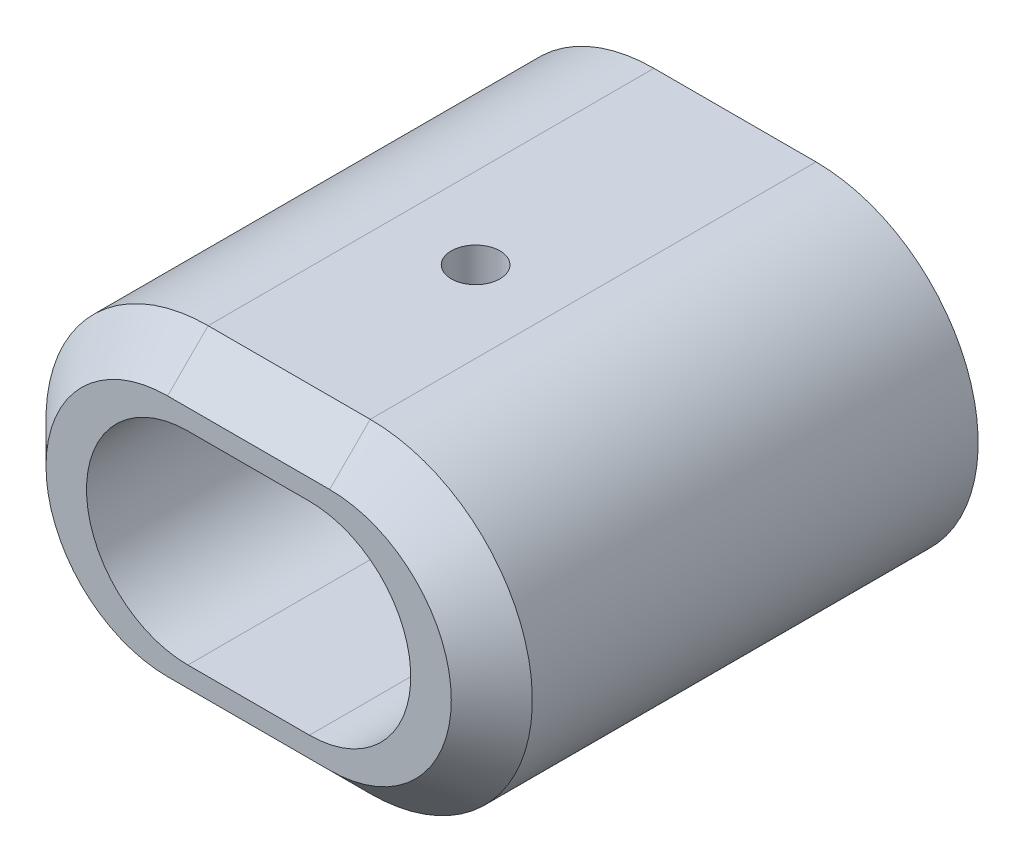
ISO-10303-21;
HEADER;
FILE_DESCRIPTION(('STEP AP214'),'2;1');
FILE_NAME('part.step','',(''),(''),'','','');
FILE_SCHEMA(('AUTOMOTIVE_DESIGN { 1 0 10303 214 1 1 1 1 }'));
ENDSEC;
DATA;
#1=APPLICATION_CONTEXT('core data for automotive mechanical design processes');
#2=APPLICATION_PROTOCOL_DEFINITION('international standard','automotive_design',2000,#1);
#3=PRODUCT_CONTEXT('',#1,'mechanical');
#4=PRODUCT('Part','Part','',(#3));
#5=PRODUCT_RELATED_PRODUCT_CATEGORY('part','',(#4));
#6=PRODUCT_DEFINITION_FORMATION('','',#4);
#7=PRODUCT_DEFINITION_CONTEXT('part definition',#1,'design');
#8=PRODUCT_DEFINITION('design','',#6,#7);
#9=PRODUCT_DEFINITION_SHAPE('','',#8);
#10=(LENGTH_UNIT() NAMED_UNIT(*) SI_UNIT(.MILLI.,.METRE.));
#11=(NAMED_UNIT(*) PLANE_ANGLE_UNIT() SI_UNIT($,.RADIAN.));
#12=(NAMED_UNIT(*) SI_UNIT($,.STERADIAN.) SOLID_ANGLE_UNIT());
#13=UNCERTAINTY_MEASURE_WITH_UNIT(LENGTH_MEASURE(1.E-05),#10,'distance_accuracy_value','');
#14=(GEOMETRIC_REPRESENTATION_CONTEXT(3) GLOBAL_UNCERTAINTY_ASSIGNED_CONTEXT((#13)) GLOBAL_UNIT_ASSIGNED_CONTEXT((#10,
#11,#12)) REPRESENTATION_CONTEXT('',''));
#15=CARTESIAN_POINT('',(0.,0.,0.));
#16=DIRECTION('',(0.,0.,1.));
#17=DIRECTION('',(1.,0.,0.));
#18=AXIS2_PLACEMENT_3D('',#15,#16,#17);
#19=CARTESIAN_POINT('',(-10.,0.,60.));
#20=DIRECTION('',(0.,0.,1.));
#21=DIRECTION('',(1.,0.,0.));
#22=AXIS2_PLACEMENT_3D('',#19,#20,#21);
#23=PLANE('',#22);
#24=CARTESIAN_POINT('',(10.,0.,60.));
#25=DIRECTION('',(0.,0.,1.));
#26=DIRECTION('',(1.,0.,0.));
#27=AXIS2_PLACEMENT_3D('',#24,#25,#26);
#28=CIRCLE('',#27,15.);
#29=CARTESIAN_POINT('',(9.99999999999999,-15.,60.));
#30=VERTEX_POINT('',#29);
#31=CARTESIAN_POINT('',(9.99999999999999,15.,60.));
#32=VERTEX_POINT('',#31);
#33=EDGE_CURVE('E183',#30,#32,#28,.T.);
#34=ORIENTED_EDGE('',*,*,#33,.T.);
#35=DIRECTION('',(-1.,0.,0.));
#36=VECTOR('',#35,1.);
#37=CARTESIAN_POINT('',(-9.99999999999999,15.,60.));
#38=LINE('',#37,#36);
#39=CARTESIAN_POINT('',(-9.99999999999999,15.,60.));
#40=VERTEX_POINT('',#39);
#41=EDGE_CURVE('E185',#32,#40,#38,.T.);
#42=ORIENTED_EDGE('',*,*,#41,.T.);
#43=CARTESIAN_POINT('',(-10.,0.,60.));
#44=DIRECTION('',(0.,0.,1.));
#45=DIRECTION('',(1.,0.,0.));
#46=AXIS2_PLACEMENT_3D('',#43,#44,#45);
#47=CIRCLE('',#46,15.);
#48=CARTESIAN_POINT('',(-9.99999999999999,-15.,60.));
#49=VERTEX_POINT('',#48);
#50=EDGE_CURVE('E174',#40,#49,#47,.T.);
#51=ORIENTED_EDGE('',*,*,#50,.T.);
#52=DIRECTION('',(1.,0.,0.));
#53=VECTOR('',#52,1.);
#54=CARTESIAN_POINT('',(9.99999999999999,-15.,60.));
#55=LINE('',#54,#53);
#56=EDGE_CURVE('E181',#49,#30,#55,.T.);
#57=ORIENTED_EDGE('',*,*,#56,.T.);
#58=EDGE_LOOP('',(#34,#42,#51,#57));
#59=FACE_BOUND('',#58,.T.);
#60=DIRECTION('',(1.,0.,0.));
#61=VECTOR('',#60,1.);
#62=CARTESIAN_POINT('',(-7.5,-12.5,60.));
#63=LINE('',#62,#61);
#64=CARTESIAN_POINT('',(-7.5,-12.5,60.));
#65=VERTEX_POINT('',#64);
#66=CARTESIAN_POINT('',(7.5,-12.5,60.));
#67=VERTEX_POINT('',#66);
#68=EDGE_CURVE('E122',#65,#67,#63,.T.);
#69=ORIENTED_EDGE('',*,*,#68,.F.);
#70=CARTESIAN_POINT('',(-7.5,0.,60.));
#71=DIRECTION('',(0.,0.,1.));
#72=DIRECTION('',(1.,0.,0.));
#73=AXIS2_PLACEMENT_3D('',#70,#71,#72);
#74=CIRCLE('',#73,12.5);
#75=CARTESIAN_POINT('',(-7.5,12.5,60.));
#76=VERTEX_POINT('',#75);
#77=EDGE_CURVE('E112',#76,#65,#74,.T.);
#78=ORIENTED_EDGE('',*,*,#77,.F.);
#79=DIRECTION('',(-1.,0.,0.));
#80=VECTOR('',#79,1.);
#81=CARTESIAN_POINT('',(-7.5,12.5,60.));
#82=LINE('',#81,#80);
#83=CARTESIAN_POINT('',(7.5,12.5,60.));
#84=VERTEX_POINT('',#83);
#85=EDGE_CURVE('E137',#84,#76,#82,.T.);
#86=ORIENTED_EDGE('',*,*,#85,.F.);
#87=CARTESIAN_POINT('',(7.5,0.,60.));
#88=DIRECTION('',(0.,0.,1.));
#89=DIRECTION('',(1.,0.,0.));
#90=AXIS2_PLACEMENT_3D('',#87,#88,#89);
#91=CIRCLE('',#90,12.5);
#92=EDGE_CURVE('E135',#67,#84,#91,.T.);
#93=ORIENTED_EDGE('',*,*,#92,.F.);
#94=EDGE_LOOP('',(#69,#78,#86,#93));
#95=FACE_BOUND('',#94,.T.);
#96=ADVANCED_FACE('F33',(#59,#95),#23,.T.);
#97=CARTESIAN_POINT('',(-10.,0.,0.));
#98=DIRECTION('',(0.,0.,1.));
#99=DIRECTION('',(1.,0.,0.));
#100=AXIS2_PLACEMENT_3D('',#97,#98,#99);
#101=PLANE('',#100);
#102=CARTESIAN_POINT('',(-10.,0.,0.));
#103=DIRECTION('',(0.,0.,1.));
#104=DIRECTION('',(1.,0.,0.));
#105=AXIS2_PLACEMENT_3D('',#102,#103,#104);
#106=CIRCLE('',#105,20.);
#107=CARTESIAN_POINT('',(-9.99999999999999,20.,0.));
#108=VERTEX_POINT('',#107);
#109=CARTESIAN_POINT('',(-9.99999999999999,-20.,0.));
#110=VERTEX_POINT('',#109);
#111=EDGE_CURVE('E130',#108,#110,#106,.T.);
#112=ORIENTED_EDGE('',*,*,#111,.F.);
#113=DIRECTION('',(-1.,0.,0.));
#114=VECTOR('',#113,1.);
#115=CARTESIAN_POINT('',(-9.99999999999999,20.,0.));
#116=LINE('',#115,#114);
#117=CARTESIAN_POINT('',(9.99999999999999,20.,0.));
#118=VERTEX_POINT('',#117);
#119=EDGE_CURVE('E163',#118,#108,#116,.T.);
#120=ORIENTED_EDGE('',*,*,#119,.F.);
#121=CARTESIAN_POINT('',(10.,0.,0.));
#122=DIRECTION('',(0.,0.,1.));
#123=DIRECTION('',(1.,0.,0.));
#124=AXIS2_PLACEMENT_3D('',#121,#122,#123);
#125=CIRCLE('',#124,20.);
#126=CARTESIAN_POINT('',(9.99999999999999,-20.,0.));
#127=VERTEX_POINT('',#126);
#128=EDGE_CURVE('E160',#127,#118,#125,.T.);
#129=ORIENTED_EDGE('',*,*,#128,.F.);
#130=DIRECTION('',(1.,0.,0.));
#131=VECTOR('',#130,1.);
#132=CARTESIAN_POINT('',(-9.99999999999999,-20.,0.));
#133=LINE('',#132,#131);
#134=EDGE_CURVE('E157',#110,#127,#133,.T.);
#135=ORIENTED_EDGE('',*,*,#134,.F.);
#136=EDGE_LOOP('',(#112,#120,#129,#135));
#137=FACE_BOUND('',#136,.T.);
#138=CARTESIAN_POINT('',(-7.5,0.,0.));
#139=DIRECTION('',(0.,0.,1.));
#140=DIRECTION('',(1.,0.,0.));
#141=AXIS2_PLACEMENT_3D('',#138,#139,#140);
#142=CIRCLE('',#141,12.5);
#143=CARTESIAN_POINT('',(-7.5,12.5,0.));
#144=VERTEX_POINT('',#143);
#145=CARTESIAN_POINT('',(-7.5,-12.5,0.));
#146=VERTEX_POINT('',#145);
#147=EDGE_CURVE('E142',#144,#146,#142,.T.);
#148=ORIENTED_EDGE('',*,*,#147,.T.);
#149=DIRECTION('',(1.,0.,0.));
#150=VECTOR('',#149,1.);
#151=CARTESIAN_POINT('',(-7.5,-12.5,0.));
#152=LINE('',#151,#150);
#153=CARTESIAN_POINT('',(7.5,-12.5,0.));
#154=VERTEX_POINT('',#153);
#155=EDGE_CURVE('E129',#146,#154,#152,.T.);
#156=ORIENTED_EDGE('',*,*,#155,.T.);
#157=CARTESIAN_POINT('',(7.5,0.,0.));
#158=DIRECTION('',(0.,0.,1.));
#159=DIRECTION('',(1.,0.,0.));
#160=AXIS2_PLACEMENT_3D('',#157,#158,#159);
#161=CIRCLE('',#160,12.5);
#162=CARTESIAN_POINT('',(7.5,12.5,0.));
#163=VERTEX_POINT('',#162);
#164=EDGE_CURVE('E146',#154,#163,#161,.T.);
#165=ORIENTED_EDGE('',*,*,#164,.T.);
#166=DIRECTION('',(-1.,0.,0.));
#167=VECTOR('',#166,1.);
#168=CARTESIAN_POINT('',(-7.5,12.5,0.));
#169=LINE('',#168,#167);
#170=EDGE_CURVE('E123',#163,#144,#169,.T.);
#171=ORIENTED_EDGE('',*,*,#170,.T.);
#172=EDGE_LOOP('',(#148,#156,#165,#171));
#173=FACE_BOUND('',#172,.T.);
#174=ADVANCED_FACE('F233',(#137,#173),#101,.F.);
#175=CARTESIAN_POINT('',(-10.,0.,60.));
#176=DIRECTION('',(0.,0.,-1.));
#177=DIRECTION('',(-1.,0.,0.));
#178=AXIS2_PLACEMENT_3D('',#175,#176,#177);
#179=CYLINDRICAL_SURFACE('',#178,20.);
#180=DIRECTION('',(0.,0.,-1.));
#181=VECTOR('',#180,1.);
#182=CARTESIAN_POINT('',(-9.99999999999999,-20.,60.));
#183=LINE('',#182,#181);
#184=CARTESIAN_POINT('',(-9.99999999999999,-20.,55.));
#185=VERTEX_POINT('',#184);
#186=EDGE_CURVE('E172',#185,#110,#183,.T.);
#187=ORIENTED_EDGE('',*,*,#186,.F.);
#188=CARTESIAN_POINT('',(-10.,0.,55.));
#189=DIRECTION('',(0.,0.,1.));
#190=DIRECTION('',(1.,0.,0.));
#191=AXIS2_PLACEMENT_3D('',#188,#189,#190);
#192=CIRCLE('',#191,20.);
#193=CARTESIAN_POINT('',(-9.99999999999999,20.,55.));
#194=VERTEX_POINT('',#193);
#195=EDGE_CURVE('E11',#185,#194,#192,.F.);
#196=ORIENTED_EDGE('',*,*,#195,.T.);
#197=DIRECTION('',(0.,0.,-1.));
#198=VECTOR('',#197,1.);
#199=CARTESIAN_POINT('',(-9.99999999999999,20.,60.));
#200=LINE('',#199,#198);
#201=EDGE_CURVE('E166',#194,#108,#200,.T.);
#202=ORIENTED_EDGE('',*,*,#201,.T.);
#203=ORIENTED_EDGE('',*,*,#111,.T.);
#204=EDGE_LOOP('',(#187,#196,#202,#203));
#205=FACE_BOUND('',#204,.T.);
#206=ADVANCED_FACE('F239',(#205),#179,.T.);
#207=CARTESIAN_POINT('',(-9.99999999999999,-20.,60.));
#208=DIRECTION('',(0.,1.,0.));
#209=DIRECTION('',(0.,0.,1.));
#210=AXIS2_PLACEMENT_3D('',#207,#208,#209);
#211=PLANE('',#210);
#212=CARTESIAN_POINT('',(0.,-20.,32.));
#213=DIRECTION('',(0.,-1.,0.));
#214=DIRECTION('',(0.,0.,-1.));
#215=AXIS2_PLACEMENT_3D('',#212,#213,#214);
#216=CIRCLE('',#215,3.);
#217=CARTESIAN_POINT('',(0.,-20.,29.));
#218=VERTEX_POINT('',#217);
#219=EDGE_CURVE('E179',#218,#218,#216,.T.);
#220=ORIENTED_EDGE('',*,*,#219,.F.);
#221=EDGE_LOOP('',(#220));
#222=FACE_BOUND('',#221,.T.);
#223=DIRECTION('',(0.,0.,-1.));
#224=VECTOR('',#223,1.);
#225=CARTESIAN_POINT('',(9.99999999999999,-20.,60.));
#226=LINE('',#225,#224);
#227=CARTESIAN_POINT('',(9.99999999999999,-20.,55.));
#228=VERTEX_POINT('',#227);
#229=EDGE_CURVE('E170',#228,#127,#226,.T.);
#230=ORIENTED_EDGE('',*,*,#229,.F.);
#231=DIRECTION('',(-1.,0.,0.));
#232=VECTOR('',#231,1.);
#233=CARTESIAN_POINT('',(-9.99999999999999,-20.,55.));
#234=LINE('',#233,#232);
#235=EDGE_CURVE('E42',#228,#185,#234,.T.);
#236=ORIENTED_EDGE('',*,*,#235,.T.);
#237=ORIENTED_EDGE('',*,*,#186,.T.);
#238=ORIENTED_EDGE('',*,*,#134,.T.);
#239=EDGE_LOOP('',(#230,#236,#237,#238));
#240=FACE_BOUND('',#239,.T.);
#241=ADVANCED_FACE('F250',(#222,#240),#211,.F.);
#242=CARTESIAN_POINT('',(10.,0.,60.));
#243=DIRECTION('',(0.,0.,-1.));
#244=DIRECTION('',(-1.,0.,0.));
#245=AXIS2_PLACEMENT_3D('',#242,#243,#244);
#246=CYLINDRICAL_SURFACE('',#245,20.);
#247=DIRECTION('',(0.,0.,-1.));
#248=VECTOR('',#247,1.);
#249=CARTESIAN_POINT('',(9.99999999999999,20.,60.));
#250=LINE('',#249,#248);
#251=CARTESIAN_POINT('',(9.99999999999999,20.,55.));
#252=VERTEX_POINT('',#251);
#253=EDGE_CURVE('E168',#252,#118,#250,.T.);
#254=ORIENTED_EDGE('',*,*,#253,.F.);
#255=CARTESIAN_POINT('',(10.,0.,55.));
#256=DIRECTION('',(0.,0.,1.));
#257=DIRECTION('',(1.,0.,0.));
#258=AXIS2_PLACEMENT_3D('',#255,#256,#257);
#259=CIRCLE('',#258,20.);
#260=EDGE_CURVE('E57',#252,#228,#259,.F.);
#261=ORIENTED_EDGE('',*,*,#260,.T.);
#262=ORIENTED_EDGE('',*,*,#229,.T.);
#263=ORIENTED_EDGE('',*,*,#128,.T.);
#264=EDGE_LOOP('',(#254,#261,#262,#263));
#265=FACE_BOUND('',#264,.T.);
#266=ADVANCED_FACE('F247',(#265),#246,.T.);
#267=CARTESIAN_POINT('',(-9.99999999999999,20.,60.));
#268=DIRECTION('',(0.,-1.,0.));
#269=DIRECTION('',(0.,0.,-1.));
#270=AXIS2_PLACEMENT_3D('',#267,#268,#269);
#271=PLANE('',#270);
#272=CARTESIAN_POINT('',(0.,20.,32.));
#273=DIRECTION('',(0.,-1.,0.));
#274=DIRECTION('',(0.,0.,-1.));
#275=AXIS2_PLACEMENT_3D('',#272,#273,#274);
#276=CIRCLE('',#275,3.);
#277=CARTESIAN_POINT('',(0.,20.,29.));
#278=VERTEX_POINT('',#277);
#279=EDGE_CURVE('E144',#278,#278,#276,.T.);
#280=ORIENTED_EDGE('',*,*,#279,.T.);
#281=EDGE_LOOP('',(#280));
#282=FACE_BOUND('',#281,.T.);
#283=ORIENTED_EDGE('',*,*,#201,.F.);
#284=DIRECTION('',(1.,0.,0.));
#285=VECTOR('',#284,1.);
#286=CARTESIAN_POINT('',(9.99999999999999,20.,55.));
#287=LINE('',#286,#285);
#288=EDGE_CURVE('E188',#194,#252,#287,.T.);
#289=ORIENTED_EDGE('',*,*,#288,.T.);
#290=ORIENTED_EDGE('',*,*,#253,.T.);
#291=ORIENTED_EDGE('',*,*,#119,.T.);
#292=EDGE_LOOP('',(#283,#289,#290,#291));
#293=FACE_BOUND('',#292,.T.);
#294=ADVANCED_FACE('F215',(#282,#293),#271,.F.);
#295=CARTESIAN_POINT('',(-7.5,0.,60.));
#296=DIRECTION('',(0.,0.,-1.));
#297=DIRECTION('',(-1.,0.,0.));
#298=AXIS2_PLACEMENT_3D('',#295,#296,#297);
#299=CYLINDRICAL_SURFACE('',#298,12.5);
#300=ORIENTED_EDGE('',*,*,#147,.F.);
#301=DIRECTION('',(0.,0.,-1.));
#302=VECTOR('',#301,1.);
#303=CARTESIAN_POINT('',(-7.5,12.5,60.));
#304=LINE('',#303,#302);
#305=EDGE_CURVE('E118',#76,#144,#304,.T.);
#306=ORIENTED_EDGE('',*,*,#305,.F.);
#307=ORIENTED_EDGE('',*,*,#77,.T.);
#308=DIRECTION('',(0.,0.,-1.));
#309=VECTOR('',#308,1.);
#310=CARTESIAN_POINT('',(-7.5,-12.5,60.));
#311=LINE('',#310,#309);
#312=EDGE_CURVE('E115',#65,#146,#311,.T.);
#313=ORIENTED_EDGE('',*,*,#312,.T.);
#314=EDGE_LOOP('',(#300,#306,#307,#313));
#315=FACE_BOUND('',#314,.T.);
#316=ADVANCED_FACE('F114',(#315),#299,.F.);
#317=CARTESIAN_POINT('',(-7.5,-12.5,60.));
#318=DIRECTION('',(0.,1.,0.));
#319=DIRECTION('',(0.,0.,1.));
#320=AXIS2_PLACEMENT_3D('',#317,#318,#319);
#321=PLANE('',#320);
#322=CARTESIAN_POINT('',(0.,-12.5,32.));
#323=DIRECTION('',(0.,1.,0.));
#324=DIRECTION('',(0.,0.,1.));
#325=AXIS2_PLACEMENT_3D('',#322,#323,#324);
#326=CIRCLE('',#325,3.);
#327=CARTESIAN_POINT('',(0.,-12.5,35.));
#328=VERTEX_POINT('',#327);
#329=EDGE_CURVE('E178',#328,#328,#326,.T.);
#330=ORIENTED_EDGE('',*,*,#329,.F.);
#331=EDGE_LOOP('',(#330));
#332=FACE_BOUND('',#331,.T.);
#333=ORIENTED_EDGE('',*,*,#155,.F.);
#334=ORIENTED_EDGE('',*,*,#312,.F.);
#335=ORIENTED_EDGE('',*,*,#68,.T.);
#336=DIRECTION('',(0.,0.,-1.));
#337=VECTOR('',#336,1.);
#338=CARTESIAN_POINT('',(7.5,-12.5,60.));
#339=LINE('',#338,#337);
#340=EDGE_CURVE('E131',#67,#154,#339,.T.);
#341=ORIENTED_EDGE('',*,*,#340,.T.);
#342=EDGE_LOOP('',(#333,#334,#335,#341));
#343=FACE_BOUND('',#342,.T.);
#344=ADVANCED_FACE('F126',(#332,#343),#321,.T.);
#345=CARTESIAN_POINT('',(7.5,0.,60.));
#346=DIRECTION('',(0.,0.,-1.));
#347=DIRECTION('',(-1.,0.,0.));
#348=AXIS2_PLACEMENT_3D('',#345,#346,#347);
#349=CYLINDRICAL_SURFACE('',#348,12.5);
#350=ORIENTED_EDGE('',*,*,#164,.F.);
#351=ORIENTED_EDGE('',*,*,#340,.F.);
#352=ORIENTED_EDGE('',*,*,#92,.T.);
#353=DIRECTION('',(0.,0.,-1.));
#354=VECTOR('',#353,1.);
#355=CARTESIAN_POINT('',(7.5,12.5,60.));
#356=LINE('',#355,#354);
#357=EDGE_CURVE('E152',#84,#163,#356,.T.);
#358=ORIENTED_EDGE('',*,*,#357,.T.);
#359=EDGE_LOOP('',(#350,#351,#352,#358));
#360=FACE_BOUND('',#359,.T.);
#361=ADVANCED_FACE('F229',(#360),#349,.F.);
#362=CARTESIAN_POINT('',(-7.5,12.5,60.));
#363=DIRECTION('',(0.,-1.,0.));
#364=DIRECTION('',(0.,0.,-1.));
#365=AXIS2_PLACEMENT_3D('',#362,#363,#364);
#366=PLANE('',#365);
#367=CARTESIAN_POINT('',(0.,12.5,32.));
#368=DIRECTION('',(0.,-1.,0.));
#369=DIRECTION('',(0.,0.,-1.));
#370=AXIS2_PLACEMENT_3D('',#367,#368,#369);
#371=CIRCLE('',#370,3.);
#372=CARTESIAN_POINT('',(0.,12.5,29.));
#373=VERTEX_POINT('',#372);
#374=EDGE_CURVE('E175',#373,#373,#371,.T.);
#375=ORIENTED_EDGE('',*,*,#374,.F.);
#376=EDGE_LOOP('',(#375));
#377=FACE_BOUND('',#376,.T.);
#378=ORIENTED_EDGE('',*,*,#170,.F.);
#379=ORIENTED_EDGE('',*,*,#357,.F.);
#380=ORIENTED_EDGE('',*,*,#85,.T.);
#381=ORIENTED_EDGE('',*,*,#305,.T.);
#382=EDGE_LOOP('',(#378,#379,#380,#381));
#383=FACE_BOUND('',#382,.T.);
#384=ADVANCED_FACE('F221',(#377,#383),#366,.T.);
#385=CARTESIAN_POINT('',(0.,40.,32.));
#386=DIRECTION('',(0.,-1.,0.));
#387=DIRECTION('',(0.,0.,-1.));
#388=AXIS2_PLACEMENT_3D('',#385,#386,#387);
#389=CYLINDRICAL_SURFACE('',#388,3.);
#390=ORIENTED_EDGE('',*,*,#374,.T.);
#391=EDGE_LOOP('',(#390));
#392=FACE_BOUND('',#391,.T.);
#393=ORIENTED_EDGE('',*,*,#279,.F.);
#394=EDGE_LOOP('',(#393));
#395=FACE_BOUND('',#394,.T.);
#396=ADVANCED_FACE('F218',(#392,#395),#389,.F.);
#397=ORIENTED_EDGE('',*,*,#329,.T.);
#398=EDGE_LOOP('',(#397));
#399=FACE_BOUND('',#398,.T.);
#400=ORIENTED_EDGE('',*,*,#219,.T.);
#401=EDGE_LOOP('',(#400));
#402=FACE_BOUND('',#401,.T.);
#403=ADVANCED_FACE('F220',(#399,#402),#389,.F.);
#404=CARTESIAN_POINT('',(-10.,-15.,60.));
#405=DIRECTION('',(0.,-0.707106781186548,0.707106781186547));
#406=DIRECTION('',(-1.,0.,0.));
#407=AXIS2_PLACEMENT_3D('',#404,#405,#406);
#408=PLANE('',#407);
#409=DIRECTION('',(0.,0.707106781186547,0.707106781186548));
#410=VECTOR('',#409,1.);
#411=CARTESIAN_POINT('',(-9.99999999999999,-20.,55.));
#412=LINE('',#411,#410);
#413=EDGE_CURVE('E196',#185,#49,#412,.T.);
#414=ORIENTED_EDGE('',*,*,#413,.F.);
#415=ORIENTED_EDGE('',*,*,#235,.F.);
#416=DIRECTION('',(0.,-0.707106781186547,-0.707106781186548));
#417=VECTOR('',#416,1.);
#418=CARTESIAN_POINT('',(9.99999999999999,-15.,60.));
#419=LINE('',#418,#417);
#420=EDGE_CURVE('E37',#30,#228,#419,.T.);
#421=ORIENTED_EDGE('',*,*,#420,.F.);
#422=ORIENTED_EDGE('',*,*,#56,.F.);
#423=EDGE_LOOP('',(#414,#415,#421,#422));
#424=FACE_BOUND('',#423,.T.);
#425=ADVANCED_FACE('F35',(#424),#408,.T.);
#426=CARTESIAN_POINT('',(10.,0.,60.));
#427=DIRECTION('',(0.,0.,-1.));
#428=DIRECTION('',(-1.,0.,0.));
#429=AXIS2_PLACEMENT_3D('',#426,#427,#428);
#430=CONICAL_SURFACE('',#429,15.,0.785398163397448);
#431=ORIENTED_EDGE('',*,*,#420,.T.);
#432=ORIENTED_EDGE('',*,*,#260,.F.);
#433=DIRECTION('',(0.,0.707106781186547,-0.707106781186548));
#434=VECTOR('',#433,1.);
#435=CARTESIAN_POINT('',(9.99999999999999,15.,60.));
#436=LINE('',#435,#434);
#437=EDGE_CURVE('E195',#32,#252,#436,.T.);
#438=ORIENTED_EDGE('',*,*,#437,.F.);
#439=ORIENTED_EDGE('',*,*,#33,.F.);
#440=EDGE_LOOP('',(#431,#432,#438,#439));
#441=FACE_BOUND('',#440,.T.);
#442=ADVANCED_FACE('F263',(#441),#430,.T.);
#443=CARTESIAN_POINT('',(-10.,0.,60.));
#444=DIRECTION('',(0.,0.,-1.));
#445=DIRECTION('',(-1.,0.,0.));
#446=AXIS2_PLACEMENT_3D('',#443,#444,#445);
#447=CONICAL_SURFACE('',#446,15.,0.785398163397448);
#448=ORIENTED_EDGE('',*,*,#413,.T.);
#449=ORIENTED_EDGE('',*,*,#50,.F.);
#450=DIRECTION('',(0.,-0.707106781186547,0.707106781186548));
#451=VECTOR('',#450,1.);
#452=CARTESIAN_POINT('',(-9.99999999999999,20.,55.));
#453=LINE('',#452,#451);
#454=EDGE_CURVE('E193',#194,#40,#453,.T.);
#455=ORIENTED_EDGE('',*,*,#454,.F.);
#456=ORIENTED_EDGE('',*,*,#195,.F.);
#457=EDGE_LOOP('',(#448,#449,#455,#456));
#458=FACE_BOUND('',#457,.T.);
#459=ADVANCED_FACE('F260',(#458),#447,.T.);
#460=CARTESIAN_POINT('',(-10.,15.,60.));
#461=DIRECTION('',(0.,0.707106781186548,0.707106781186547));
#462=DIRECTION('',(1.,0.,0.));
#463=AXIS2_PLACEMENT_3D('',#460,#461,#462);
#464=PLANE('',#463);
#465=ORIENTED_EDGE('',*,*,#437,.T.);
#466=ORIENTED_EDGE('',*,*,#288,.F.);
#467=ORIENTED_EDGE('',*,*,#454,.T.);
#468=ORIENTED_EDGE('',*,*,#41,.F.);
#469=EDGE_LOOP('',(#465,#466,#467,#468));
#470=FACE_BOUND('',#469,.T.);
#471=ADVANCED_FACE('F257',(#470),#464,.T.);
#472=CLOSED_SHELL('',(#96,#174,#206,#241,#266,#294,#316,#344,#361,#384,#396,#403,#425,#442,#459,#471));
#473=MANIFOLD_SOLID_BREP('B2',#472);
#474=ADVANCED_BREP_SHAPE_REPRESENTATION('',(#18,#473),#14);
#475=SHAPE_DEFINITION_REPRESENTATION(#9,#474);
ENDSEC;
END-ISO-10303-21;
